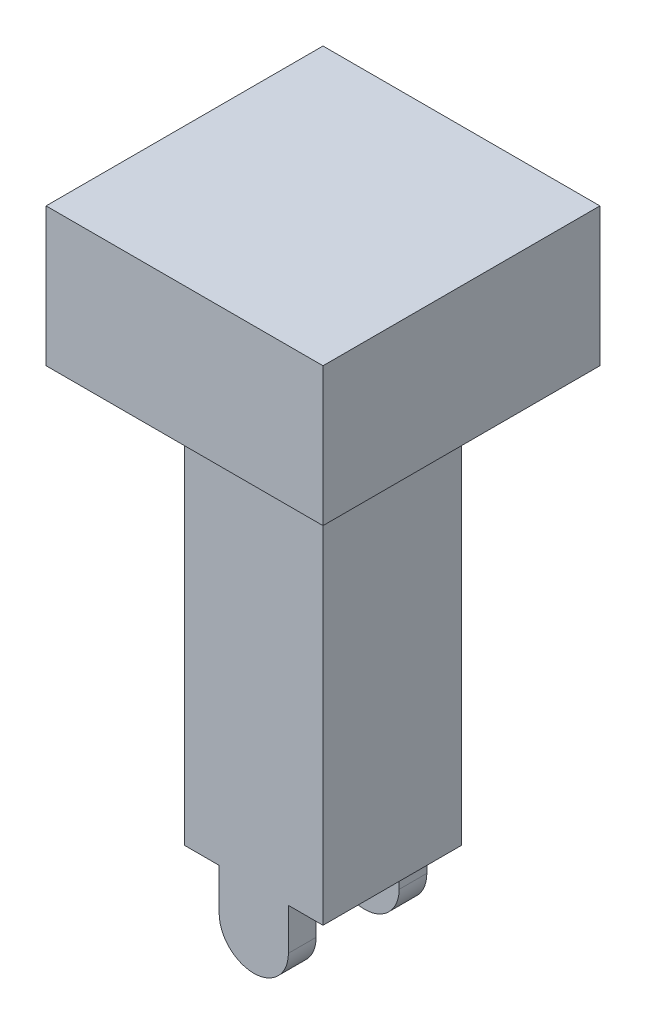
ISO-10303-21;
HEADER;
FILE_DESCRIPTION(('STEP AP214'),'2;1');
FILE_NAME('part.step','',(''),(''),'','','');
FILE_SCHEMA(('AUTOMOTIVE_DESIGN { 1 0 10303 214 1 1 1 1 }'));
ENDSEC;
DATA;
#1=APPLICATION_CONTEXT('core data for automotive mechanical design processes');
#2=APPLICATION_PROTOCOL_DEFINITION('international standard','automotive_design',2000,#1);
#3=PRODUCT_CONTEXT('',#1,'mechanical');
#4=PRODUCT('Part','Part','',(#3));
#5=PRODUCT_RELATED_PRODUCT_CATEGORY('part','',(#4));
#6=PRODUCT_DEFINITION_FORMATION('','',#4);
#7=PRODUCT_DEFINITION_CONTEXT('part definition',#1,'design');
#8=PRODUCT_DEFINITION('design','',#6,#7);
#9=PRODUCT_DEFINITION_SHAPE('','',#8);
#10=(LENGTH_UNIT() NAMED_UNIT(*) SI_UNIT(.MILLI.,.METRE.));
#11=(NAMED_UNIT(*) PLANE_ANGLE_UNIT() SI_UNIT($,.RADIAN.));
#12=(NAMED_UNIT(*) SI_UNIT($,.STERADIAN.) SOLID_ANGLE_UNIT());
#13=UNCERTAINTY_MEASURE_WITH_UNIT(LENGTH_MEASURE(1.E-05),#10,'distance_accuracy_value','');
#14=(GEOMETRIC_REPRESENTATION_CONTEXT(3) GLOBAL_UNCERTAINTY_ASSIGNED_CONTEXT((#13)) GLOBAL_UNIT_ASSIGNED_CONTEXT((#10,
#11,#12)) REPRESENTATION_CONTEXT('',''));
#15=CARTESIAN_POINT('',(0.,0.,0.));
#16=DIRECTION('',(0.,0.,1.));
#17=DIRECTION('',(1.,0.,0.));
#18=AXIS2_PLACEMENT_3D('',#15,#16,#17);
#19=CARTESIAN_POINT('',(0.,-30.,0.));
#20=DIRECTION('',(0.,-1.,0.));
#21=DIRECTION('',(0.,0.,-1.));
#22=AXIS2_PLACEMENT_3D('',#19,#20,#21);
#23=PLANE('',#22);
#24=DIRECTION('',(-1.,0.,0.));
#25=VECTOR('',#24,1.);
#26=CARTESIAN_POINT('',(-5.,-30.,5.));
#27=LINE('',#26,#25);
#28=CARTESIAN_POINT('',(5.,-30.,5.));
#29=VERTEX_POINT('',#28);
#30=CARTESIAN_POINT('',(2.5,-30.,5.));
#31=VERTEX_POINT('',#30);
#32=EDGE_CURVE('E247',#29,#31,#27,.T.);
#33=ORIENTED_EDGE('',*,*,#32,.T.);
#34=DIRECTION('',(0.,0.,1.));
#35=VECTOR('',#34,1.);
#36=CARTESIAN_POINT('',(2.5,-30.,3.));
#37=LINE('',#36,#35);
#38=CARTESIAN_POINT('',(2.5,-30.,3.));
#39=VERTEX_POINT('',#38);
#40=EDGE_CURVE('E196',#39,#31,#37,.T.);
#41=ORIENTED_EDGE('',*,*,#40,.F.);
#42=DIRECTION('',(1.,0.,0.));
#43=VECTOR('',#42,1.);
#44=CARTESIAN_POINT('',(-2.5,-30.,3.));
#45=LINE('',#44,#43);
#46=CARTESIAN_POINT('',(-2.5,-30.,3.));
#47=VERTEX_POINT('',#46);
#48=EDGE_CURVE('E186',#47,#39,#45,.T.);
#49=ORIENTED_EDGE('',*,*,#48,.F.);
#50=DIRECTION('',(0.,0.,-1.));
#51=VECTOR('',#50,1.);
#52=CARTESIAN_POINT('',(-2.5,-30.,3.));
#53=LINE('',#52,#51);
#54=CARTESIAN_POINT('',(-2.5,-30.,5.));
#55=VERTEX_POINT('',#54);
#56=EDGE_CURVE('E191',#55,#47,#53,.T.);
#57=ORIENTED_EDGE('',*,*,#56,.F.);
#58=CARTESIAN_POINT('',(-5.,-30.,5.));
#59=VERTEX_POINT('',#58);
#60=EDGE_CURVE('E169',#55,#59,#27,.T.);
#61=ORIENTED_EDGE('',*,*,#60,.T.);
#62=DIRECTION('',(0.,0.,-1.));
#63=VECTOR('',#62,1.);
#64=CARTESIAN_POINT('',(-5.,-30.,5.));
#65=LINE('',#64,#63);
#66=CARTESIAN_POINT('',(-5.,-30.,-5.));
#67=VERTEX_POINT('',#66);
#68=EDGE_CURVE('E251',#59,#67,#65,.T.);
#69=ORIENTED_EDGE('',*,*,#68,.T.);
#70=DIRECTION('',(1.,0.,0.));
#71=VECTOR('',#70,1.);
#72=CARTESIAN_POINT('',(-5.,-30.,-5.));
#73=LINE('',#72,#71);
#74=CARTESIAN_POINT('',(-2.5,-30.,-5.));
#75=VERTEX_POINT('',#74);
#76=EDGE_CURVE('E255',#67,#75,#73,.T.);
#77=ORIENTED_EDGE('',*,*,#76,.T.);
#78=DIRECTION('',(0.,0.,-1.));
#79=VECTOR('',#78,1.);
#80=CARTESIAN_POINT('',(-2.5,-30.,-3.));
#81=LINE('',#80,#79);
#82=CARTESIAN_POINT('',(-2.5,-30.,-3.));
#83=VERTEX_POINT('',#82);
#84=EDGE_CURVE('E214',#83,#75,#81,.T.);
#85=ORIENTED_EDGE('',*,*,#84,.F.);
#86=DIRECTION('',(-1.,0.,0.));
#87=VECTOR('',#86,1.);
#88=CARTESIAN_POINT('',(-2.5,-30.,-3.));
#89=LINE('',#88,#87);
#90=CARTESIAN_POINT('',(2.5,-30.,-3.));
#91=VERTEX_POINT('',#90);
#92=EDGE_CURVE('E63',#91,#83,#89,.T.);
#93=ORIENTED_EDGE('',*,*,#92,.F.);
#94=DIRECTION('',(0.,0.,1.));
#95=VECTOR('',#94,1.);
#96=CARTESIAN_POINT('',(2.5,-30.,-3.));
#97=LINE('',#96,#95);
#98=CARTESIAN_POINT('',(2.5,-30.,-5.));
#99=VERTEX_POINT('',#98);
#100=EDGE_CURVE('E208',#99,#91,#97,.T.);
#101=ORIENTED_EDGE('',*,*,#100,.F.);
#102=CARTESIAN_POINT('',(5.,-30.,-5.));
#103=VERTEX_POINT('',#102);
#104=EDGE_CURVE('E254',#99,#103,#73,.T.);
#105=ORIENTED_EDGE('',*,*,#104,.T.);
#106=DIRECTION('',(0.,0.,1.));
#107=VECTOR('',#106,1.);
#108=CARTESIAN_POINT('',(5.,-30.,5.));
#109=LINE('',#108,#107);
#110=EDGE_CURVE('E242',#103,#29,#109,.T.);
#111=ORIENTED_EDGE('',*,*,#110,.T.);
#112=EDGE_LOOP('',(#33,#41,#49,#57,#61,#69,#77,#85,#93,#101,#105,#111));
#113=FACE_BOUND('',#112,.T.);
#114=ADVANCED_FACE('F39',(#113),#23,.T.);
#115=CARTESIAN_POINT('',(0.,0.,0.));
#116=DIRECTION('',(0.,1.,0.));
#117=DIRECTION('',(0.,0.,1.));
#118=AXIS2_PLACEMENT_3D('',#115,#116,#117);
#119=PLANE('',#118);
#120=DIRECTION('',(0.,0.,-1.));
#121=VECTOR('',#120,1.);
#122=CARTESIAN_POINT('',(10.,0.,-10.));
#123=LINE('',#122,#121);
#124=CARTESIAN_POINT('',(10.,0.,10.));
#125=VERTEX_POINT('',#124);
#126=CARTESIAN_POINT('',(10.,0.,-10.));
#127=VERTEX_POINT('',#126);
#128=EDGE_CURVE('E288',#125,#127,#123,.T.);
#129=ORIENTED_EDGE('',*,*,#128,.F.);
#130=DIRECTION('',(1.,0.,0.));
#131=VECTOR('',#130,1.);
#132=CARTESIAN_POINT('',(-10.,0.,10.));
#133=LINE('',#132,#131);
#134=CARTESIAN_POINT('',(-10.,0.,10.));
#135=VERTEX_POINT('',#134);
#136=EDGE_CURVE('E294',#135,#125,#133,.T.);
#137=ORIENTED_EDGE('',*,*,#136,.F.);
#138=DIRECTION('',(0.,0.,1.));
#139=VECTOR('',#138,1.);
#140=CARTESIAN_POINT('',(-10.,0.,-10.));
#141=LINE('',#140,#139);
#142=CARTESIAN_POINT('',(-10.,0.,-10.));
#143=VERTEX_POINT('',#142);
#144=EDGE_CURVE('E310',#143,#135,#141,.T.);
#145=ORIENTED_EDGE('',*,*,#144,.F.);
#146=DIRECTION('',(-1.,0.,0.));
#147=VECTOR('',#146,1.);
#148=CARTESIAN_POINT('',(-10.,0.,-10.));
#149=LINE('',#148,#147);
#150=EDGE_CURVE('E307',#127,#143,#149,.T.);
#151=ORIENTED_EDGE('',*,*,#150,.F.);
#152=EDGE_LOOP('',(#129,#137,#145,#151));
#153=FACE_BOUND('',#152,.T.);
#154=DIRECTION('',(0.,0.,1.));
#155=VECTOR('',#154,1.);
#156=CARTESIAN_POINT('',(5.,0.,5.));
#157=LINE('',#156,#155);
#158=CARTESIAN_POINT('',(5.,0.,-5.));
#159=VERTEX_POINT('',#158);
#160=CARTESIAN_POINT('',(5.,0.,5.));
#161=VERTEX_POINT('',#160);
#162=EDGE_CURVE('E241',#159,#161,#157,.T.);
#163=ORIENTED_EDGE('',*,*,#162,.F.);
#164=DIRECTION('',(1.,0.,0.));
#165=VECTOR('',#164,1.);
#166=CARTESIAN_POINT('',(-5.,0.,-5.));
#167=LINE('',#166,#165);
#168=CARTESIAN_POINT('',(-5.,0.,-5.));
#169=VERTEX_POINT('',#168);
#170=EDGE_CURVE('E246',#169,#159,#167,.T.);
#171=ORIENTED_EDGE('',*,*,#170,.F.);
#172=DIRECTION('',(0.,0.,-1.));
#173=VECTOR('',#172,1.);
#174=CARTESIAN_POINT('',(-5.,0.,5.));
#175=LINE('',#174,#173);
#176=CARTESIAN_POINT('',(-5.,0.,5.));
#177=VERTEX_POINT('',#176);
#178=EDGE_CURVE('E266',#177,#169,#175,.T.);
#179=ORIENTED_EDGE('',*,*,#178,.F.);
#180=DIRECTION('',(-1.,0.,0.));
#181=VECTOR('',#180,1.);
#182=CARTESIAN_POINT('',(-5.,0.,5.));
#183=LINE('',#182,#181);
#184=EDGE_CURVE('E262',#161,#177,#183,.T.);
#185=ORIENTED_EDGE('',*,*,#184,.F.);
#186=EDGE_LOOP('',(#163,#171,#179,#185));
#187=FACE_BOUND('',#186,.T.);
#188=ADVANCED_FACE('F333',(#153,#187),#119,.F.);
#189=CARTESIAN_POINT('',(10.,10.,-10.));
#190=DIRECTION('',(-1.,0.,0.));
#191=DIRECTION('',(0.,0.,1.));
#192=AXIS2_PLACEMENT_3D('',#189,#190,#191);
#193=PLANE('',#192);
#194=ORIENTED_EDGE('',*,*,#128,.T.);
#195=DIRECTION('',(0.,-1.,0.));
#196=VECTOR('',#195,1.);
#197=CARTESIAN_POINT('',(10.,10.,-10.));
#198=LINE('',#197,#196);
#199=CARTESIAN_POINT('',(10.,10.,-10.));
#200=VERTEX_POINT('',#199);
#201=EDGE_CURVE('E11',#200,#127,#198,.T.);
#202=ORIENTED_EDGE('',*,*,#201,.F.);
#203=DIRECTION('',(0.,0.,-1.));
#204=VECTOR('',#203,1.);
#205=CARTESIAN_POINT('',(10.,10.,-10.));
#206=LINE('',#205,#204);
#207=CARTESIAN_POINT('',(10.,10.,10.));
#208=VERTEX_POINT('',#207);
#209=EDGE_CURVE('E289',#208,#200,#206,.T.);
#210=ORIENTED_EDGE('',*,*,#209,.F.);
#211=DIRECTION('',(0.,-1.,0.));
#212=VECTOR('',#211,1.);
#213=CARTESIAN_POINT('',(10.,10.,10.));
#214=LINE('',#213,#212);
#215=EDGE_CURVE('E303',#208,#125,#214,.T.);
#216=ORIENTED_EDGE('',*,*,#215,.T.);
#217=EDGE_LOOP('',(#194,#202,#210,#216));
#218=FACE_BOUND('',#217,.T.);
#219=ADVANCED_FACE('F41',(#218),#193,.F.);
#220=CARTESIAN_POINT('',(-10.,10.,-10.));
#221=DIRECTION('',(0.,0.,1.));
#222=DIRECTION('',(1.,0.,0.));
#223=AXIS2_PLACEMENT_3D('',#220,#221,#222);
#224=PLANE('',#223);
#225=ORIENTED_EDGE('',*,*,#150,.T.);
#226=DIRECTION('',(0.,-1.,0.));
#227=VECTOR('',#226,1.);
#228=CARTESIAN_POINT('',(-10.,10.,-10.));
#229=LINE('',#228,#227);
#230=CARTESIAN_POINT('',(-10.,10.,-10.));
#231=VERTEX_POINT('',#230);
#232=EDGE_CURVE('E48',#231,#143,#229,.T.);
#233=ORIENTED_EDGE('',*,*,#232,.F.);
#234=DIRECTION('',(-1.,0.,0.));
#235=VECTOR('',#234,1.);
#236=CARTESIAN_POINT('',(-10.,10.,-10.));
#237=LINE('',#236,#235);
#238=EDGE_CURVE('E293',#200,#231,#237,.T.);
#239=ORIENTED_EDGE('',*,*,#238,.F.);
#240=ORIENTED_EDGE('',*,*,#201,.T.);
#241=EDGE_LOOP('',(#225,#233,#239,#240));
#242=FACE_BOUND('',#241,.T.);
#243=ADVANCED_FACE('F344',(#242),#224,.F.);
#244=CARTESIAN_POINT('',(-10.,10.,-10.));
#245=DIRECTION('',(1.,0.,0.));
#246=DIRECTION('',(0.,0.,-1.));
#247=AXIS2_PLACEMENT_3D('',#244,#245,#246);
#248=PLANE('',#247);
#249=ORIENTED_EDGE('',*,*,#144,.T.);
#250=DIRECTION('',(0.,-1.,0.));
#251=VECTOR('',#250,1.);
#252=CARTESIAN_POINT('',(-10.,10.,10.));
#253=LINE('',#252,#251);
#254=CARTESIAN_POINT('',(-10.,10.,10.));
#255=VERTEX_POINT('',#254);
#256=EDGE_CURVE('E318',#255,#135,#253,.T.);
#257=ORIENTED_EDGE('',*,*,#256,.F.);
#258=DIRECTION('',(0.,0.,1.));
#259=VECTOR('',#258,1.);
#260=CARTESIAN_POINT('',(-10.,10.,-10.));
#261=LINE('',#260,#259);
#262=EDGE_CURVE('E297',#231,#255,#261,.T.);
#263=ORIENTED_EDGE('',*,*,#262,.F.);
#264=ORIENTED_EDGE('',*,*,#232,.T.);
#265=EDGE_LOOP('',(#249,#257,#263,#264));
#266=FACE_BOUND('',#265,.T.);
#267=ADVANCED_FACE('F327',(#266),#248,.F.);
#268=CARTESIAN_POINT('',(-10.,10.,10.));
#269=DIRECTION('',(0.,0.,-1.));
#270=DIRECTION('',(-1.,0.,0.));
#271=AXIS2_PLACEMENT_3D('',#268,#269,#270);
#272=PLANE('',#271);
#273=ORIENTED_EDGE('',*,*,#136,.T.);
#274=ORIENTED_EDGE('',*,*,#215,.F.);
#275=DIRECTION('',(1.,0.,0.));
#276=VECTOR('',#275,1.);
#277=CARTESIAN_POINT('',(-10.,10.,10.));
#278=LINE('',#277,#276);
#279=EDGE_CURVE('E300',#255,#208,#278,.T.);
#280=ORIENTED_EDGE('',*,*,#279,.F.);
#281=ORIENTED_EDGE('',*,*,#256,.T.);
#282=EDGE_LOOP('',(#273,#274,#280,#281));
#283=FACE_BOUND('',#282,.T.);
#284=ADVANCED_FACE('F337',(#283),#272,.F.);
#285=CARTESIAN_POINT('',(0.,10.,0.));
#286=DIRECTION('',(0.,1.,0.));
#287=DIRECTION('',(0.,0.,1.));
#288=AXIS2_PLACEMENT_3D('',#285,#286,#287);
#289=PLANE('',#288);
#290=ORIENTED_EDGE('',*,*,#209,.T.);
#291=ORIENTED_EDGE('',*,*,#238,.T.);
#292=ORIENTED_EDGE('',*,*,#262,.T.);
#293=ORIENTED_EDGE('',*,*,#279,.T.);
#294=EDGE_LOOP('',(#290,#291,#292,#293));
#295=FACE_BOUND('',#294,.T.);
#296=ADVANCED_FACE('F343',(#295),#289,.T.);
#297=CARTESIAN_POINT('',(5.,-30.,5.));
#298=DIRECTION('',(-1.,0.,0.));
#299=DIRECTION('',(0.,0.,1.));
#300=AXIS2_PLACEMENT_3D('',#297,#298,#299);
#301=PLANE('',#300);
#302=ORIENTED_EDGE('',*,*,#162,.T.);
#303=DIRECTION('',(0.,1.,0.));
#304=VECTOR('',#303,1.);
#305=CARTESIAN_POINT('',(5.,-30.,5.));
#306=LINE('',#305,#304);
#307=EDGE_CURVE('E284',#29,#161,#306,.T.);
#308=ORIENTED_EDGE('',*,*,#307,.F.);
#309=ORIENTED_EDGE('',*,*,#110,.F.);
#310=DIRECTION('',(0.,1.,0.));
#311=VECTOR('',#310,1.);
#312=CARTESIAN_POINT('',(5.,-30.,-5.));
#313=LINE('',#312,#311);
#314=EDGE_CURVE('E258',#103,#159,#313,.T.);
#315=ORIENTED_EDGE('',*,*,#314,.T.);
#316=EDGE_LOOP('',(#302,#308,#309,#315));
#317=FACE_BOUND('',#316,.T.);
#318=ADVANCED_FACE('F371',(#317),#301,.F.);
#319=CARTESIAN_POINT('',(-5.,-30.,5.));
#320=DIRECTION('',(0.,0.,-1.));
#321=DIRECTION('',(-1.,0.,0.));
#322=AXIS2_PLACEMENT_3D('',#319,#320,#321);
#323=PLANE('',#322);
#324=DIRECTION('',(0.,1.,0.));
#325=VECTOR('',#324,1.);
#326=CARTESIAN_POINT('',(-2.5,-33.,5.));
#327=LINE('',#326,#325);
#328=CARTESIAN_POINT('',(-2.50000000000001,-33.,5.));
#329=VERTEX_POINT('',#328);
#330=EDGE_CURVE('E55',#329,#55,#327,.T.);
#331=ORIENTED_EDGE('',*,*,#330,.F.);
#332=CARTESIAN_POINT('',(0.,-33.,5.));
#333=DIRECTION('',(0.,0.,-1.));
#334=DIRECTION('',(-1.,0.,0.));
#335=AXIS2_PLACEMENT_3D('',#332,#333,#334);
#336=CIRCLE('',#335,2.5);
#337=CARTESIAN_POINT('',(2.5,-33.,5.));
#338=VERTEX_POINT('',#337);
#339=EDGE_CURVE('E167',#338,#329,#336,.T.);
#340=ORIENTED_EDGE('',*,*,#339,.F.);
#341=DIRECTION('',(0.,1.,0.));
#342=VECTOR('',#341,1.);
#343=CARTESIAN_POINT('',(2.5,-33.,5.));
#344=LINE('',#343,#342);
#345=EDGE_CURVE('E171',#338,#31,#344,.T.);
#346=ORIENTED_EDGE('',*,*,#345,.T.);
#347=ORIENTED_EDGE('',*,*,#32,.F.);
#348=ORIENTED_EDGE('',*,*,#307,.T.);
#349=ORIENTED_EDGE('',*,*,#184,.T.);
#350=DIRECTION('',(0.,1.,0.));
#351=VECTOR('',#350,1.);
#352=CARTESIAN_POINT('',(-5.,-30.,5.));
#353=LINE('',#352,#351);
#354=EDGE_CURVE('E280',#59,#177,#353,.T.);
#355=ORIENTED_EDGE('',*,*,#354,.F.);
#356=ORIENTED_EDGE('',*,*,#60,.F.);
#357=EDGE_LOOP('',(#331,#340,#346,#347,#348,#349,#355,#356));
#358=FACE_BOUND('',#357,.T.);
#359=ADVANCED_FACE('F165',(#358),#323,.F.);
#360=CARTESIAN_POINT('',(-5.,-30.,5.));
#361=DIRECTION('',(1.,0.,0.));
#362=DIRECTION('',(0.,0.,-1.));
#363=AXIS2_PLACEMENT_3D('',#360,#361,#362);
#364=PLANE('',#363);
#365=ORIENTED_EDGE('',*,*,#178,.T.);
#366=DIRECTION('',(0.,1.,0.));
#367=VECTOR('',#366,1.);
#368=CARTESIAN_POINT('',(-5.,-30.,-5.));
#369=LINE('',#368,#367);
#370=EDGE_CURVE('E276',#67,#169,#369,.T.);
#371=ORIENTED_EDGE('',*,*,#370,.F.);
#372=ORIENTED_EDGE('',*,*,#68,.F.);
#373=ORIENTED_EDGE('',*,*,#354,.T.);
#374=EDGE_LOOP('',(#365,#371,#372,#373));
#375=FACE_BOUND('',#374,.T.);
#376=ADVANCED_FACE('F364',(#375),#364,.F.);
#377=CARTESIAN_POINT('',(-5.,-30.,-5.));
#378=DIRECTION('',(0.,0.,1.));
#379=DIRECTION('',(1.,0.,0.));
#380=AXIS2_PLACEMENT_3D('',#377,#378,#379);
#381=PLANE('',#380);
#382=DIRECTION('',(0.,1.,0.));
#383=VECTOR('',#382,1.);
#384=CARTESIAN_POINT('',(2.5,-33.,-5.));
#385=LINE('',#384,#383);
#386=CARTESIAN_POINT('',(2.49999999999999,-33.,-5.));
#387=VERTEX_POINT('',#386);
#388=EDGE_CURVE('E218',#387,#99,#385,.T.);
#389=ORIENTED_EDGE('',*,*,#388,.F.);
#390=CARTESIAN_POINT('',(0.,-33.,-5.));
#391=DIRECTION('',(0.,0.,-1.));
#392=DIRECTION('',(-1.,0.,0.));
#393=AXIS2_PLACEMENT_3D('',#390,#391,#392);
#394=CIRCLE('',#393,2.5);
#395=CARTESIAN_POINT('',(-2.5,-33.,-5.));
#396=VERTEX_POINT('',#395);
#397=EDGE_CURVE('E179',#387,#396,#394,.T.);
#398=ORIENTED_EDGE('',*,*,#397,.T.);
#399=DIRECTION('',(0.,1.,0.));
#400=VECTOR('',#399,1.);
#401=CARTESIAN_POINT('',(-2.5,-33.,-5.));
#402=LINE('',#401,#400);
#403=EDGE_CURVE('E230',#396,#75,#402,.T.);
#404=ORIENTED_EDGE('',*,*,#403,.T.);
#405=ORIENTED_EDGE('',*,*,#76,.F.);
#406=ORIENTED_EDGE('',*,*,#370,.T.);
#407=ORIENTED_EDGE('',*,*,#170,.T.);
#408=ORIENTED_EDGE('',*,*,#314,.F.);
#409=ORIENTED_EDGE('',*,*,#104,.F.);
#410=EDGE_LOOP('',(#389,#398,#404,#405,#406,#407,#408,#409));
#411=FACE_BOUND('',#410,.T.);
#412=ADVANCED_FACE('F361',(#411),#381,.F.);
#413=CARTESIAN_POINT('',(2.5,-33.,-3.));
#414=DIRECTION('',(-1.,0.,0.));
#415=DIRECTION('',(0.,0.,1.));
#416=AXIS2_PLACEMENT_3D('',#413,#414,#415);
#417=PLANE('',#416);
#418=ORIENTED_EDGE('',*,*,#100,.T.);
#419=DIRECTION('',(0.,1.,0.));
#420=VECTOR('',#419,1.);
#421=CARTESIAN_POINT('',(2.5,-33.,-3.));
#422=LINE('',#421,#420);
#423=CARTESIAN_POINT('',(2.5,-33.,-3.));
#424=VERTEX_POINT('',#423);
#425=EDGE_CURVE('E238',#424,#91,#422,.T.);
#426=ORIENTED_EDGE('',*,*,#425,.F.);
#427=DIRECTION('',(0.,0.,1.));
#428=VECTOR('',#427,1.);
#429=CARTESIAN_POINT('',(2.5,-33.,-3.));
#430=LINE('',#429,#428);
#431=EDGE_CURVE('E209',#387,#424,#430,.T.);
#432=ORIENTED_EDGE('',*,*,#431,.F.);
#433=ORIENTED_EDGE('',*,*,#388,.T.);
#434=EDGE_LOOP('',(#418,#426,#432,#433));
#435=FACE_BOUND('',#434,.T.);
#436=ADVANCED_FACE('F359',(#435),#417,.F.);
#437=CARTESIAN_POINT('',(-2.5,-33.,-3.));
#438=DIRECTION('',(0.,0.,-1.));
#439=DIRECTION('',(-1.,0.,0.));
#440=AXIS2_PLACEMENT_3D('',#437,#438,#439);
#441=PLANE('',#440);
#442=DIRECTION('',(0.,1.,0.));
#443=VECTOR('',#442,1.);
#444=CARTESIAN_POINT('',(-2.5,-33.,-3.));
#445=LINE('',#444,#443);
#446=CARTESIAN_POINT('',(-2.5,-33.,-3.));
#447=VERTEX_POINT('',#446);
#448=EDGE_CURVE('E234',#447,#83,#445,.T.);
#449=ORIENTED_EDGE('',*,*,#448,.F.);
#450=CARTESIAN_POINT('',(0.,-33.,-3.));
#451=DIRECTION('',(0.,0.,-1.));
#452=DIRECTION('',(-1.,0.,0.));
#453=AXIS2_PLACEMENT_3D('',#450,#451,#452);
#454=CIRCLE('',#453,2.5);
#455=EDGE_CURVE('E182',#424,#447,#454,.T.);
#456=ORIENTED_EDGE('',*,*,#455,.F.);
#457=ORIENTED_EDGE('',*,*,#425,.T.);
#458=ORIENTED_EDGE('',*,*,#92,.T.);
#459=EDGE_LOOP('',(#449,#456,#457,#458));
#460=FACE_BOUND('',#459,.T.);
#461=ADVANCED_FACE('F411',(#460),#441,.F.);
#462=CARTESIAN_POINT('',(-2.5,-33.,-3.));
#463=DIRECTION('',(1.,0.,0.));
#464=DIRECTION('',(0.,0.,-1.));
#465=AXIS2_PLACEMENT_3D('',#462,#463,#464);
#466=PLANE('',#465);
#467=ORIENTED_EDGE('',*,*,#84,.T.);
#468=ORIENTED_EDGE('',*,*,#403,.F.);
#469=DIRECTION('',(0.,0.,-1.));
#470=VECTOR('',#469,1.);
#471=CARTESIAN_POINT('',(-2.5,-33.,-3.));
#472=LINE('',#471,#470);
#473=EDGE_CURVE('E213',#447,#396,#472,.T.);
#474=ORIENTED_EDGE('',*,*,#473,.F.);
#475=ORIENTED_EDGE('',*,*,#448,.T.);
#476=EDGE_LOOP('',(#467,#468,#474,#475));
#477=FACE_BOUND('',#476,.T.);
#478=ADVANCED_FACE('F418',(#477),#466,.F.);
#479=CARTESIAN_POINT('',(-2.5,-33.,3.));
#480=DIRECTION('',(0.,0.,1.));
#481=DIRECTION('',(1.,0.,0.));
#482=AXIS2_PLACEMENT_3D('',#479,#480,#481);
#483=PLANE('',#482);
#484=DIRECTION('',(0.,1.,0.));
#485=VECTOR('',#484,1.);
#486=CARTESIAN_POINT('',(2.5,-33.,3.));
#487=LINE('',#486,#485);
#488=CARTESIAN_POINT('',(2.5,-33.,3.));
#489=VERTEX_POINT('',#488);
#490=EDGE_CURVE('E205',#489,#39,#487,.T.);
#491=ORIENTED_EDGE('',*,*,#490,.F.);
#492=CARTESIAN_POINT('',(0.,-33.,3.));
#493=DIRECTION('',(0.,0.,-1.));
#494=DIRECTION('',(-1.,0.,0.));
#495=AXIS2_PLACEMENT_3D('',#492,#493,#494);
#496=CIRCLE('',#495,2.5);
#497=CARTESIAN_POINT('',(-2.5,-33.,3.));
#498=VERTEX_POINT('',#497);
#499=EDGE_CURVE('E176',#489,#498,#496,.T.);
#500=ORIENTED_EDGE('',*,*,#499,.T.);
#501=DIRECTION('',(0.,1.,0.));
#502=VECTOR('',#501,1.);
#503=CARTESIAN_POINT('',(-2.5,-33.,3.));
#504=LINE('',#503,#502);
#505=EDGE_CURVE('E154',#498,#47,#504,.T.);
#506=ORIENTED_EDGE('',*,*,#505,.T.);
#507=ORIENTED_EDGE('',*,*,#48,.T.);
#508=EDGE_LOOP('',(#491,#500,#506,#507));
#509=FACE_BOUND('',#508,.T.);
#510=ADVANCED_FACE('F425',(#509),#483,.F.);
#511=CARTESIAN_POINT('',(2.5,-33.,3.));
#512=DIRECTION('',(-1.,0.,0.));
#513=DIRECTION('',(0.,0.,1.));
#514=AXIS2_PLACEMENT_3D('',#511,#512,#513);
#515=PLANE('',#514);
#516=ORIENTED_EDGE('',*,*,#40,.T.);
#517=ORIENTED_EDGE('',*,*,#345,.F.);
#518=DIRECTION('',(0.,0.,1.));
#519=VECTOR('',#518,1.);
#520=CARTESIAN_POINT('',(2.5,-33.,3.));
#521=LINE('',#520,#519);
#522=EDGE_CURVE('E160',#489,#338,#521,.T.);
#523=ORIENTED_EDGE('',*,*,#522,.F.);
#524=ORIENTED_EDGE('',*,*,#490,.T.);
#525=EDGE_LOOP('',(#516,#517,#523,#524));
#526=FACE_BOUND('',#525,.T.);
#527=ADVANCED_FACE('F432',(#526),#515,.F.);
#528=CARTESIAN_POINT('',(-2.5,-33.,3.));
#529=DIRECTION('',(1.,0.,0.));
#530=DIRECTION('',(0.,0.,-1.));
#531=AXIS2_PLACEMENT_3D('',#528,#529,#530);
#532=PLANE('',#531);
#533=ORIENTED_EDGE('',*,*,#56,.T.);
#534=ORIENTED_EDGE('',*,*,#505,.F.);
#535=DIRECTION('',(0.,0.,-1.));
#536=VECTOR('',#535,1.);
#537=CARTESIAN_POINT('',(-2.5,-33.,3.));
#538=LINE('',#537,#536);
#539=EDGE_CURVE('E151',#329,#498,#538,.T.);
#540=ORIENTED_EDGE('',*,*,#539,.F.);
#541=ORIENTED_EDGE('',*,*,#330,.T.);
#542=EDGE_LOOP('',(#533,#534,#540,#541));
#543=FACE_BOUND('',#542,.T.);
#544=ADVANCED_FACE('F152',(#543),#532,.F.);
#545=CARTESIAN_POINT('',(0.,-33.,-3.));
#546=DIRECTION('',(0.,0.,-1.));
#547=DIRECTION('',(-1.,0.,0.));
#548=AXIS2_PLACEMENT_3D('',#545,#546,#547);
#549=CYLINDRICAL_SURFACE('',#548,2.5);
#550=ORIENTED_EDGE('',*,*,#455,.T.);
#551=ORIENTED_EDGE('',*,*,#473,.T.);
#552=ORIENTED_EDGE('',*,*,#397,.F.);
#553=ORIENTED_EDGE('',*,*,#431,.T.);
#554=EDGE_LOOP('',(#550,#551,#552,#553));
#555=FACE_BOUND('',#554,.T.);
#556=ADVANCED_FACE('F447',(#555),#549,.T.);
#557=CARTESIAN_POINT('',(0.,-33.,3.));
#558=DIRECTION('',(0.,0.,1.));
#559=DIRECTION('',(1.,0.,0.));
#560=AXIS2_PLACEMENT_3D('',#557,#558,#559);
#561=CYLINDRICAL_SURFACE('',#560,2.5);
#562=ORIENTED_EDGE('',*,*,#522,.T.);
#563=ORIENTED_EDGE('',*,*,#339,.T.);
#564=ORIENTED_EDGE('',*,*,#539,.T.);
#565=ORIENTED_EDGE('',*,*,#499,.F.);
#566=EDGE_LOOP('',(#562,#563,#564,#565));
#567=FACE_BOUND('',#566,.T.);
#568=ADVANCED_FACE('F174',(#567),#561,.T.);
#569=CLOSED_SHELL('',(#114,#188,#219,#243,#267,#284,#296,#318,#359,#376,#412,#436,#461,#478,
#510,#527,#544,#556,#568));
#570=MANIFOLD_SOLID_BREP('B2',#569);
#571=ADVANCED_BREP_SHAPE_REPRESENTATION('',(#18,#570),#14);
#572=SHAPE_DEFINITION_REPRESENTATION(#9,#571);
ENDSEC;
END-ISO-10303-21;
